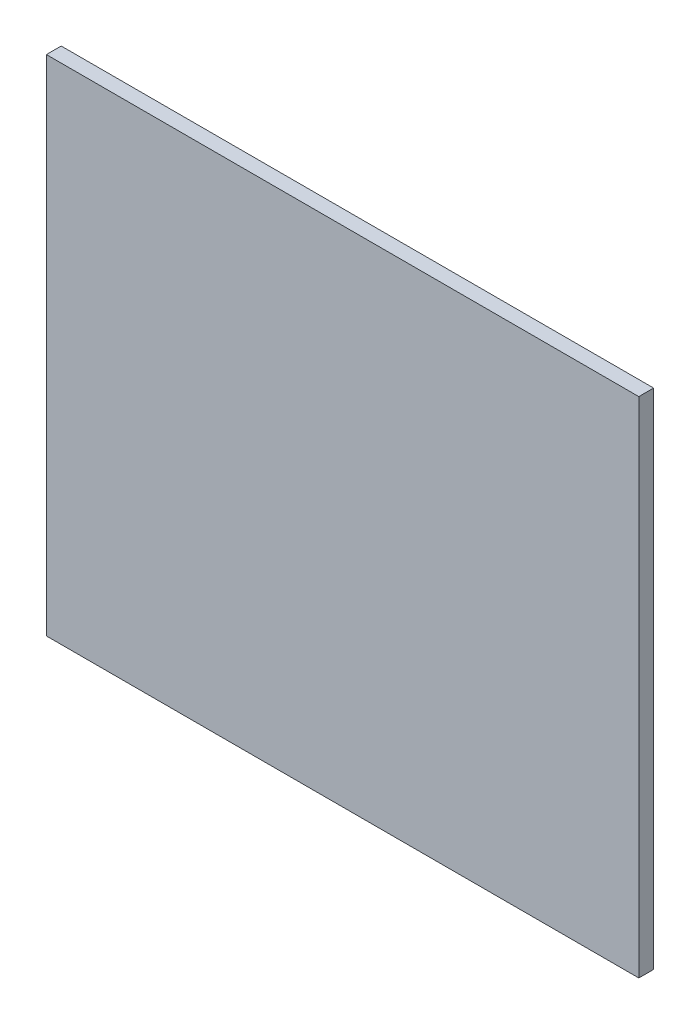
ISO-10303-21;
HEADER;
FILE_DESCRIPTION(('STEP AP214'),'2;1');
FILE_NAME('part.step','',(''),(''),'','','');
FILE_SCHEMA(('AUTOMOTIVE_DESIGN { 1 0 10303 214 1 1 1 1 }'));
ENDSEC;
DATA;
#1=APPLICATION_CONTEXT('core data for automotive mechanical design processes');
#2=APPLICATION_PROTOCOL_DEFINITION('international standard','automotive_design',2000,#1);
#3=PRODUCT_CONTEXT('',#1,'mechanical');
#4=PRODUCT('Part','Part','',(#3));
#5=PRODUCT_RELATED_PRODUCT_CATEGORY('part','',(#4));
#6=PRODUCT_DEFINITION_FORMATION('','',#4);
#7=PRODUCT_DEFINITION_CONTEXT('part definition',#1,'design');
#8=PRODUCT_DEFINITION('design','',#6,#7);
#9=PRODUCT_DEFINITION_SHAPE('','',#8);
#10=(LENGTH_UNIT() NAMED_UNIT(*) SI_UNIT(.MILLI.,.METRE.));
#11=(NAMED_UNIT(*) PLANE_ANGLE_UNIT() SI_UNIT($,.RADIAN.));
#12=(NAMED_UNIT(*) SI_UNIT($,.STERADIAN.) SOLID_ANGLE_UNIT());
#13=UNCERTAINTY_MEASURE_WITH_UNIT(LENGTH_MEASURE(1.E-05),#10,'distance_accuracy_value','');
#14=(GEOMETRIC_REPRESENTATION_CONTEXT(3) GLOBAL_UNCERTAINTY_ASSIGNED_CONTEXT((#13)) GLOBAL_UNIT_ASSIGNED_CONTEXT((#10,
#11,#12)) REPRESENTATION_CONTEXT('',''));
#15=CARTESIAN_POINT('',(0.,0.,0.));
#16=DIRECTION('',(0.,0.,1.));
#17=DIRECTION('',(1.,0.,0.));
#18=AXIS2_PLACEMENT_3D('',#15,#16,#17);
#19=CARTESIAN_POINT('',(0.,0.,1.));
#20=DIRECTION('',(1.,0.,0.));
#21=DIRECTION('',(0.,0.,-1.));
#22=AXIS2_PLACEMENT_3D('',#19,#20,#21);
#23=PLANE('',#22);
#24=DIRECTION('',(0.,-1.,0.));
#25=VECTOR('',#24,1.);
#26=CARTESIAN_POINT('',(0.,0.,0.));
#27=LINE('',#26,#25);
#28=CARTESIAN_POINT('',(0.,33.98,0.));
#29=VERTEX_POINT('',#28);
#30=CARTESIAN_POINT('',(0.,0.,0.));
#31=VERTEX_POINT('',#30);
#32=EDGE_CURVE('E98',#29,#31,#27,.T.);
#33=ORIENTED_EDGE('',*,*,#32,.T.);
#34=DIRECTION('',(0.,0.,-1.));
#35=VECTOR('',#34,1.);
#36=CARTESIAN_POINT('',(0.,0.,1.));
#37=LINE('',#36,#35);
#38=CARTESIAN_POINT('',(0.,0.,1.));
#39=VERTEX_POINT('',#38);
#40=EDGE_CURVE('E11',#39,#31,#37,.T.);
#41=ORIENTED_EDGE('',*,*,#40,.F.);
#42=DIRECTION('',(0.,-1.,0.));
#43=VECTOR('',#42,1.);
#44=CARTESIAN_POINT('',(0.,0.,1.));
#45=LINE('',#44,#43);
#46=CARTESIAN_POINT('',(0.,33.98,1.));
#47=VERTEX_POINT('',#46);
#48=EDGE_CURVE('E86',#47,#39,#45,.T.);
#49=ORIENTED_EDGE('',*,*,#48,.F.);
#50=DIRECTION('',(0.,0.,-1.));
#51=VECTOR('',#50,1.);
#52=CARTESIAN_POINT('',(0.,33.98,1.));
#53=LINE('',#52,#51);
#54=EDGE_CURVE('E94',#47,#29,#53,.T.);
#55=ORIENTED_EDGE('',*,*,#54,.T.);
#56=EDGE_LOOP('',(#33,#41,#49,#55));
#57=FACE_BOUND('',#56,.T.);
#58=ADVANCED_FACE('F35',(#57),#23,.F.);
#59=CARTESIAN_POINT('',(0.,0.,1.));
#60=DIRECTION('',(0.,1.,0.));
#61=DIRECTION('',(0.,0.,1.));
#62=AXIS2_PLACEMENT_3D('',#59,#60,#61);
#63=PLANE('',#62);
#64=DIRECTION('',(1.,0.,0.));
#65=VECTOR('',#64,1.);
#66=CARTESIAN_POINT('',(0.,0.,0.));
#67=LINE('',#66,#65);
#68=CARTESIAN_POINT('',(39.98,0.,0.));
#69=VERTEX_POINT('',#68);
#70=EDGE_CURVE('E90',#31,#69,#67,.T.);
#71=ORIENTED_EDGE('',*,*,#70,.T.);
#72=DIRECTION('',(0.,0.,-1.));
#73=VECTOR('',#72,1.);
#74=CARTESIAN_POINT('',(39.98,0.,1.));
#75=LINE('',#74,#73);
#76=CARTESIAN_POINT('',(39.98,0.,1.));
#77=VERTEX_POINT('',#76);
#78=EDGE_CURVE('E43',#77,#69,#75,.T.);
#79=ORIENTED_EDGE('',*,*,#78,.F.);
#80=DIRECTION('',(1.,0.,0.));
#81=VECTOR('',#80,1.);
#82=CARTESIAN_POINT('',(0.,0.,1.));
#83=LINE('',#82,#81);
#84=EDGE_CURVE('E81',#39,#77,#83,.T.);
#85=ORIENTED_EDGE('',*,*,#84,.F.);
#86=ORIENTED_EDGE('',*,*,#40,.T.);
#87=EDGE_LOOP('',(#71,#79,#85,#86));
#88=FACE_BOUND('',#87,.T.);
#89=ADVANCED_FACE('F89',(#88),#63,.F.);
#90=CARTESIAN_POINT('',(39.98,0.,1.));
#91=DIRECTION('',(-1.,0.,0.));
#92=DIRECTION('',(0.,0.,1.));
#93=AXIS2_PLACEMENT_3D('',#90,#91,#92);
#94=PLANE('',#93);
#95=DIRECTION('',(0.,1.,0.));
#96=VECTOR('',#95,1.);
#97=CARTESIAN_POINT('',(39.98,0.,0.));
#98=LINE('',#97,#96);
#99=CARTESIAN_POINT('',(39.98,33.98,0.));
#100=VERTEX_POINT('',#99);
#101=EDGE_CURVE('E68',#69,#100,#98,.T.);
#102=ORIENTED_EDGE('',*,*,#101,.T.);
#103=DIRECTION('',(0.,0.,-1.));
#104=VECTOR('',#103,1.);
#105=CARTESIAN_POINT('',(39.98,33.98,1.));
#106=LINE('',#105,#104);
#107=CARTESIAN_POINT('',(39.98,33.98,1.));
#108=VERTEX_POINT('',#107);
#109=EDGE_CURVE('E91',#108,#100,#106,.T.);
#110=ORIENTED_EDGE('',*,*,#109,.F.);
#111=DIRECTION('',(0.,1.,0.));
#112=VECTOR('',#111,1.);
#113=CARTESIAN_POINT('',(39.98,0.,1.));
#114=LINE('',#113,#112);
#115=EDGE_CURVE('E84',#77,#108,#114,.T.);
#116=ORIENTED_EDGE('',*,*,#115,.F.);
#117=ORIENTED_EDGE('',*,*,#78,.T.);
#118=EDGE_LOOP('',(#102,#110,#116,#117));
#119=FACE_BOUND('',#118,.T.);
#120=ADVANCED_FACE('F92',(#119),#94,.F.);
#121=CARTESIAN_POINT('',(0.,33.98,1.));
#122=DIRECTION('',(0.,-1.,0.));
#123=DIRECTION('',(0.,0.,-1.));
#124=AXIS2_PLACEMENT_3D('',#121,#122,#123);
#125=PLANE('',#124);
#126=DIRECTION('',(-1.,0.,0.));
#127=VECTOR('',#126,1.);
#128=CARTESIAN_POINT('',(0.,33.98,0.));
#129=LINE('',#128,#127);
#130=EDGE_CURVE('E74',#100,#29,#129,.T.);
#131=ORIENTED_EDGE('',*,*,#130,.T.);
#132=ORIENTED_EDGE('',*,*,#54,.F.);
#133=DIRECTION('',(-1.,0.,0.));
#134=VECTOR('',#133,1.);
#135=CARTESIAN_POINT('',(0.,33.98,1.));
#136=LINE('',#135,#134);
#137=EDGE_CURVE('E51',#108,#47,#136,.T.);
#138=ORIENTED_EDGE('',*,*,#137,.F.);
#139=ORIENTED_EDGE('',*,*,#109,.T.);
#140=EDGE_LOOP('',(#131,#132,#138,#139));
#141=FACE_BOUND('',#140,.T.);
#142=ADVANCED_FACE('F105',(#141),#125,.F.);
#143=CARTESIAN_POINT('',(0.,0.,1.));
#144=DIRECTION('',(0.,0.,-1.));
#145=DIRECTION('',(-1.,0.,0.));
#146=AXIS2_PLACEMENT_3D('',#143,#144,#145);
#147=PLANE('',#146);
#148=ORIENTED_EDGE('',*,*,#48,.T.);
#149=ORIENTED_EDGE('',*,*,#84,.T.);
#150=ORIENTED_EDGE('',*,*,#115,.T.);
#151=ORIENTED_EDGE('',*,*,#137,.T.);
#152=EDGE_LOOP('',(#148,#149,#150,#151));
#153=FACE_BOUND('',#152,.T.);
#154=ADVANCED_FACE('F82',(#153),#147,.F.);
#155=CARTESIAN_POINT('',(0.,0.,0.));
#156=DIRECTION('',(0.,0.,-1.));
#157=DIRECTION('',(-1.,0.,0.));
#158=AXIS2_PLACEMENT_3D('',#155,#156,#157);
#159=PLANE('',#158);
#160=ORIENTED_EDGE('',*,*,#32,.F.);
#161=ORIENTED_EDGE('',*,*,#130,.F.);
#162=ORIENTED_EDGE('',*,*,#101,.F.);
#163=ORIENTED_EDGE('',*,*,#70,.F.);
#164=EDGE_LOOP('',(#160,#161,#162,#163));
#165=FACE_BOUND('',#164,.T.);
#166=ADVANCED_FACE('F108',(#165),#159,.T.);
#167=CLOSED_SHELL('',(#58,#89,#120,#142,#154,#166));
#168=MANIFOLD_SOLID_BREP('B2',#167);
#169=ADVANCED_BREP_SHAPE_REPRESENTATION('',(#18,#168),#14);
#170=SHAPE_DEFINITION_REPRESENTATION(#9,#169);
ENDSEC;
END-ISO-10303-21;
